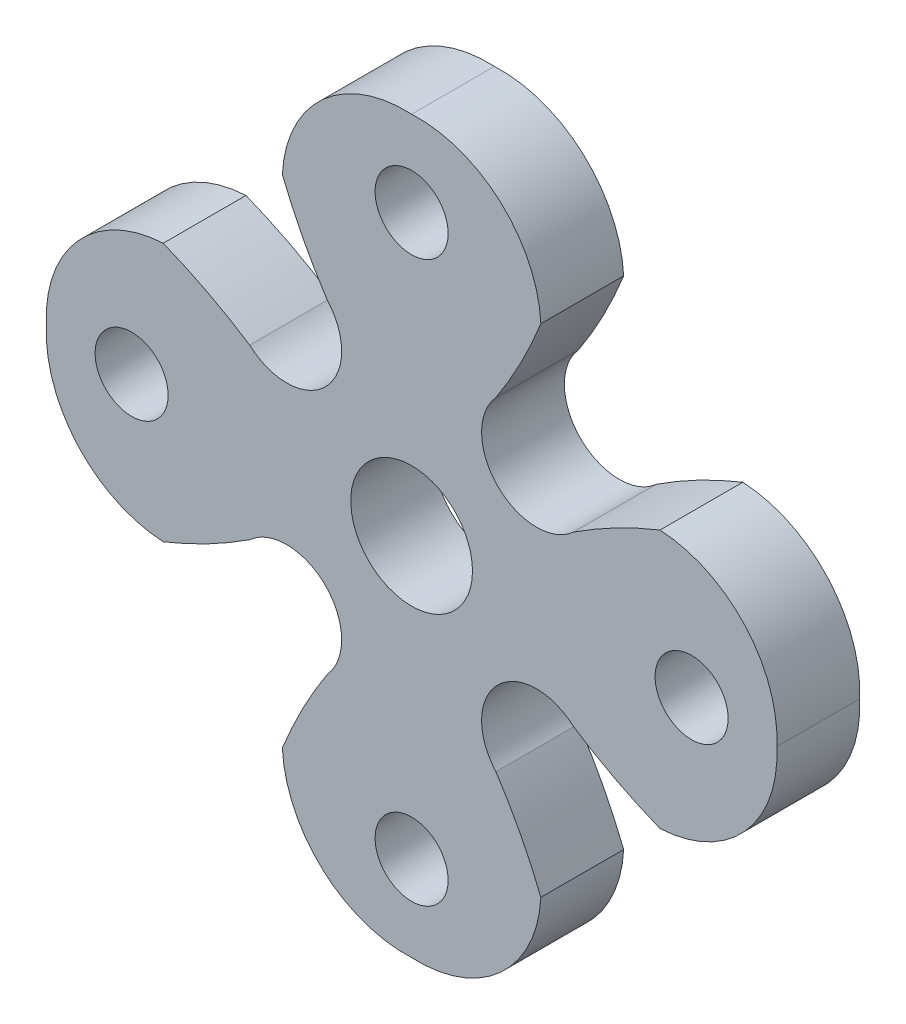
ISO-10303-21;
HEADER;
FILE_DESCRIPTION(('STEP AP214'),'2;1');
FILE_NAME('part.step','',(''),(''),'','','');
FILE_SCHEMA(('AUTOMOTIVE_DESIGN { 1 0 10303 214 1 1 1 1 }'));
ENDSEC;
DATA;
#1=APPLICATION_CONTEXT('core data for automotive mechanical design processes');
#2=APPLICATION_PROTOCOL_DEFINITION('international standard','automotive_design',2000,#1);
#3=PRODUCT_CONTEXT('',#1,'mechanical');
#4=PRODUCT('Part','Part','',(#3));
#5=PRODUCT_RELATED_PRODUCT_CATEGORY('part','',(#4));
#6=PRODUCT_DEFINITION_FORMATION('','',#4);
#7=PRODUCT_DEFINITION_CONTEXT('part definition',#1,'design');
#8=PRODUCT_DEFINITION('design','',#6,#7);
#9=PRODUCT_DEFINITION_SHAPE('','',#8);
#10=(LENGTH_UNIT() NAMED_UNIT(*) SI_UNIT(.MILLI.,.METRE.));
#11=(NAMED_UNIT(*) PLANE_ANGLE_UNIT() SI_UNIT($,.RADIAN.));
#12=(NAMED_UNIT(*) SI_UNIT($,.STERADIAN.) SOLID_ANGLE_UNIT());
#13=UNCERTAINTY_MEASURE_WITH_UNIT(LENGTH_MEASURE(1.E-05),#10,'distance_accuracy_value','');
#14=(GEOMETRIC_REPRESENTATION_CONTEXT(3) GLOBAL_UNCERTAINTY_ASSIGNED_CONTEXT((#13)) GLOBAL_UNIT_ASSIGNED_CONTEXT((#10,
#11,#12)) REPRESENTATION_CONTEXT('',''));
#15=CARTESIAN_POINT('',(0.,0.,0.));
#16=DIRECTION('',(0.,0.,1.));
#17=DIRECTION('',(1.,0.,0.));
#18=AXIS2_PLACEMENT_3D('',#15,#16,#17);
#19=CARTESIAN_POINT('',(0.,12.6314843790541,4.318));
#20=DIRECTION('',(0.,0.,1.));
#21=DIRECTION('',(1.,0.,0.));
#22=AXIS2_PLACEMENT_3D('',#19,#20,#21);
#23=PLANE('',#22);
#24=CARTESIAN_POINT('',(0.,-14.6050000000001,4.318));
#25=DIRECTION('',(0.,0.,1.));
#26=DIRECTION('',(1.,0.,0.));
#27=AXIS2_PLACEMENT_3D('',#24,#25,#26);
#28=CIRCLE('',#27,1.905);
#29=CARTESIAN_POINT('',(1.90499999999995,-14.6050000000001,4.318));
#30=VERTEX_POINT('',#29);
#31=EDGE_CURVE('E470',#30,#30,#28,.T.);
#32=ORIENTED_EDGE('',*,*,#31,.F.);
#33=EDGE_LOOP('',(#32));
#34=FACE_BOUND('',#33,.T.);
#35=CARTESIAN_POINT('',(0.,14.605,4.318));
#36=DIRECTION('',(0.,0.,1.));
#37=DIRECTION('',(1.,0.,0.));
#38=AXIS2_PLACEMENT_3D('',#35,#36,#37);
#39=CIRCLE('',#38,1.905);
#40=CARTESIAN_POINT('',(1.905,14.605,4.318));
#41=VERTEX_POINT('',#40);
#42=EDGE_CURVE('E486',#41,#41,#39,.T.);
#43=ORIENTED_EDGE('',*,*,#42,.F.);
#44=EDGE_LOOP('',(#43));
#45=FACE_BOUND('',#44,.T.);
#46=CARTESIAN_POINT('',(0.323998289302988,12.6314843790541,4.318));
#47=DIRECTION('',(0.,0.,1.));
#48=DIRECTION('',(1.,0.,0.));
#49=AXIS2_PLACEMENT_3D('',#46,#47,#48);
#50=CIRCLE('',#49,6.42668792363519);
#51=CARTESIAN_POINT('',(6.74251391024893,12.955482668357,4.318));
#52=VERTEX_POINT('',#51);
#53=CARTESIAN_POINT('',(0.,19.05,4.318));
#54=VERTEX_POINT('',#53);
#55=EDGE_CURVE('E278',#52,#54,#50,.T.);
#56=ORIENTED_EDGE('',*,*,#55,.T.);
#57=CARTESIAN_POINT('',(-0.323998289302988,12.6314843790541,4.318));
#58=DIRECTION('',(0.,0.,1.));
#59=DIRECTION('',(-1.,0.,0.));
#60=AXIS2_PLACEMENT_3D('',#57,#58,#59);
#61=CIRCLE('',#60,6.42668792363519);
#62=CARTESIAN_POINT('',(-6.74251391024893,12.955482668357,4.318));
#63=VERTEX_POINT('',#62);
#64=EDGE_CURVE('E142',#54,#63,#61,.T.);
#65=ORIENTED_EDGE('',*,*,#64,.T.);
#66=CARTESIAN_POINT('',(16.8484319813905,22.3696885264068,4.318));
#67=DIRECTION('',(0.,0.,1.));
#68=DIRECTION('',(1.,0.,0.));
#69=AXIS2_PLACEMENT_3D('',#66,#67,#68);
#70=CIRCLE('',#69,25.4);
#71=CARTESIAN_POINT('',(-4.39729168059713,8.44922782718938,4.318));
#72=VERTEX_POINT('',#71);
#73=EDGE_CURVE('E347',#63,#72,#70,.T.);
#74=ORIENTED_EDGE('',*,*,#73,.T.);
#75=CARTESIAN_POINT('',(-6.51832531290557,6.51832531290564,4.318));
#76=DIRECTION('',(0.,0.,-1.));
#77=DIRECTION('',(1.,0.,0.));
#78=AXIS2_PLACEMENT_3D('',#75,#76,#77);
#79=CIRCLE('',#78,2.86830406147096);
#80=CARTESIAN_POINT('',(-8.44922782718933,4.39729168059722,4.318));
#81=VERTEX_POINT('',#80);
#82=EDGE_CURVE('E367',#72,#81,#79,.T.);
#83=ORIENTED_EDGE('',*,*,#82,.T.);
#84=CARTESIAN_POINT('',(-22.369688526407,-16.8484319813903,4.318));
#85=DIRECTION('',(0.,0.,1.));
#86=DIRECTION('',(-1.,0.,0.));
#87=AXIS2_PLACEMENT_3D('',#84,#85,#86);
#88=CIRCLE('',#87,25.4);
#89=CARTESIAN_POINT('',(-12.955482668357,6.74251391024907,4.318));
#90=VERTEX_POINT('',#89);
#91=EDGE_CURVE('E363',#81,#90,#88,.T.);
#92=ORIENTED_EDGE('',*,*,#91,.T.);
#93=CARTESIAN_POINT('',(-12.6314843790541,0.323998289303122,4.318));
#94=DIRECTION('',(0.,0.,1.));
#95=DIRECTION('',(1.,0.,0.));
#96=AXIS2_PLACEMENT_3D('',#93,#94,#95);
#97=CIRCLE('',#96,6.42668792363519);
#98=CARTESIAN_POINT('',(-19.05,2.02366335494419E-13,4.318));
#99=VERTEX_POINT('',#98);
#100=EDGE_CURVE('E366',#90,#99,#97,.T.);
#101=ORIENTED_EDGE('',*,*,#100,.T.);
#102=CARTESIAN_POINT('',(-12.6314843790541,-0.323998289302854,4.318));
#103=DIRECTION('',(0.,0.,1.));
#104=DIRECTION('',(-1.,0.,0.));
#105=AXIS2_PLACEMENT_3D('',#102,#103,#104);
#106=CIRCLE('',#105,6.42668792363519);
#107=CARTESIAN_POINT('',(-12.9554826683571,-6.7425139102488,4.318));
#108=VERTEX_POINT('',#107);
#109=EDGE_CURVE('E371',#99,#108,#106,.T.);
#110=ORIENTED_EDGE('',*,*,#109,.T.);
#111=CARTESIAN_POINT('',(-22.3696885264066,16.8484319813908,4.318));
#112=DIRECTION('',(0.,0.,1.));
#113=DIRECTION('',(1.,0.,0.));
#114=AXIS2_PLACEMENT_3D('',#111,#112,#113);
#115=CIRCLE('',#114,25.4);
#116=CARTESIAN_POINT('',(-8.44922782718944,-4.39729168059705,4.318));
#117=VERTEX_POINT('',#116);
#118=EDGE_CURVE('E378',#108,#117,#115,.T.);
#119=ORIENTED_EDGE('',*,*,#118,.T.);
#120=CARTESIAN_POINT('',(-6.51832531290571,-6.5183253129055,4.318));
#121=DIRECTION('',(0.,0.,-1.));
#122=DIRECTION('',(1.,0.,0.));
#123=AXIS2_PLACEMENT_3D('',#120,#121,#122);
#124=CIRCLE('',#123,2.86830406147102);
#125=CARTESIAN_POINT('',(-4.39729168059724,-8.4492278271893,4.318));
#126=VERTEX_POINT('',#125);
#127=EDGE_CURVE('E381',#117,#126,#124,.T.);
#128=ORIENTED_EDGE('',*,*,#127,.T.);
#129=CARTESIAN_POINT('',(16.8484319813904,-22.3696885264069,4.318));
#130=DIRECTION('',(0.,0.,1.));
#131=DIRECTION('',(-1.,0.,0.));
#132=AXIS2_PLACEMENT_3D('',#129,#130,#131);
#133=CIRCLE('',#132,25.4);
#134=CARTESIAN_POINT('',(-6.74251391024902,-12.955482668357,4.318));
#135=VERTEX_POINT('',#134);
#136=EDGE_CURVE('E384',#126,#135,#133,.T.);
#137=ORIENTED_EDGE('',*,*,#136,.T.);
#138=CARTESIAN_POINT('',(-0.323998289303076,-12.6314843790541,4.318));
#139=DIRECTION('',(0.,0.,1.));
#140=DIRECTION('',(1.,0.,0.));
#141=AXIS2_PLACEMENT_3D('',#138,#139,#140);
#142=CIRCLE('',#141,6.42668792363519);
#143=CARTESIAN_POINT('',(-1.36880524276295E-13,-19.05,4.318));
#144=VERTEX_POINT('',#143);
#145=EDGE_CURVE('E387',#135,#144,#142,.T.);
#146=ORIENTED_EDGE('',*,*,#145,.T.);
#147=CARTESIAN_POINT('',(0.3239982893029,-12.6314843790541,4.318));
#148=DIRECTION('',(0.,0.,1.));
#149=DIRECTION('',(-1.,0.,0.));
#150=AXIS2_PLACEMENT_3D('',#147,#148,#149);
#151=CIRCLE('',#150,6.42668792363519);
#152=CARTESIAN_POINT('',(6.74251391024884,-12.9554826683571,4.318));
#153=VERTEX_POINT('',#152);
#154=EDGE_CURVE('E390',#144,#153,#151,.T.);
#155=ORIENTED_EDGE('',*,*,#154,.T.);
#156=CARTESIAN_POINT('',(-16.8484319813907,-22.3696885264067,4.318));
#157=DIRECTION('',(0.,0.,1.));
#158=DIRECTION('',(1.,0.,0.));
#159=AXIS2_PLACEMENT_3D('',#156,#157,#158);
#160=CIRCLE('',#159,25.4);
#161=CARTESIAN_POINT('',(4.39729168059707,-8.44922782718941,4.318));
#162=VERTEX_POINT('',#161);
#163=EDGE_CURVE('E393',#153,#162,#160,.T.);
#164=ORIENTED_EDGE('',*,*,#163,.T.);
#165=CARTESIAN_POINT('',(6.51832531290553,-6.51832531290569,4.318));
#166=DIRECTION('',(0.,0.,-1.));
#167=DIRECTION('',(1.,0.,0.));
#168=AXIS2_PLACEMENT_3D('',#165,#166,#167);
#169=CIRCLE('',#168,2.86830406147102);
#170=CARTESIAN_POINT('',(8.44922782718931,-4.3972916805972,4.318));
#171=VERTEX_POINT('',#170);
#172=EDGE_CURVE('E396',#162,#171,#169,.T.);
#173=ORIENTED_EDGE('',*,*,#172,.T.);
#174=CARTESIAN_POINT('',(22.3696885264069,16.8484319813905,4.318));
#175=DIRECTION('',(0.,0.,1.));
#176=DIRECTION('',(-1.,0.,0.));
#177=AXIS2_PLACEMENT_3D('',#174,#175,#176);
#178=CIRCLE('',#177,25.4);
#179=CARTESIAN_POINT('',(12.955482668357,-6.74251391024898,4.318));
#180=VERTEX_POINT('',#179);
#181=EDGE_CURVE('E399',#171,#180,#178,.T.);
#182=ORIENTED_EDGE('',*,*,#181,.T.);
#183=CARTESIAN_POINT('',(12.6314843790541,-0.323998289303032,4.318));
#184=DIRECTION('',(0.,0.,1.));
#185=DIRECTION('',(1.,0.,0.));
#186=AXIS2_PLACEMENT_3D('',#183,#184,#185);
#187=CIRCLE('',#186,6.42668792363519);
#188=CARTESIAN_POINT('',(19.05,0.,4.318));
#189=VERTEX_POINT('',#188);
#190=EDGE_CURVE('E402',#180,#189,#187,.T.);
#191=ORIENTED_EDGE('',*,*,#190,.T.);
#192=CARTESIAN_POINT('',(12.6314843790541,0.323998289302944,4.318));
#193=DIRECTION('',(0.,0.,1.));
#194=DIRECTION('',(-1.,0.,0.));
#195=AXIS2_PLACEMENT_3D('',#192,#193,#194);
#196=CIRCLE('',#195,6.42668792363519);
#197=CARTESIAN_POINT('',(12.9554826683571,6.74251391024889,4.318));
#198=VERTEX_POINT('',#197);
#199=EDGE_CURVE('E197',#189,#198,#196,.T.);
#200=ORIENTED_EDGE('',*,*,#199,.T.);
#201=CARTESIAN_POINT('',(22.3696885264067,-16.8484319813906,4.318));
#202=DIRECTION('',(0.,0.,1.));
#203=DIRECTION('',(1.,0.,0.));
#204=AXIS2_PLACEMENT_3D('',#201,#202,#203);
#205=CIRCLE('',#204,25.4);
#206=CARTESIAN_POINT('',(8.44922782718939,4.3972916805971,4.318));
#207=VERTEX_POINT('',#206);
#208=EDGE_CURVE('E191',#198,#207,#205,.T.);
#209=ORIENTED_EDGE('',*,*,#208,.T.);
#210=CARTESIAN_POINT('',(6.51832531290566,6.51832531290555,4.318));
#211=DIRECTION('',(0.,0.,-1.));
#212=DIRECTION('',(1.,0.,0.));
#213=AXIS2_PLACEMENT_3D('',#210,#211,#212);
#214=CIRCLE('',#213,2.86830406147102);
#215=CARTESIAN_POINT('',(4.39729168059718,8.44922782718933,4.318));
#216=VERTEX_POINT('',#215);
#217=EDGE_CURVE('E195',#207,#216,#214,.T.);
#218=ORIENTED_EDGE('',*,*,#217,.T.);
#219=CARTESIAN_POINT('',(-16.8484319813905,22.3696885264068,4.318));
#220=DIRECTION('',(0.,0.,1.));
#221=DIRECTION('',(-1.,0.,0.));
#222=AXIS2_PLACEMENT_3D('',#219,#220,#221);
#223=CIRCLE('',#222,25.4);
#224=EDGE_CURVE('E63',#216,#52,#223,.T.);
#225=ORIENTED_EDGE('',*,*,#224,.T.);
#226=EDGE_LOOP('',(#56,#65,#74,#83,#92,#101,#110,#119,#128,#137,#146,#155,#164,#173,#182,#191,
#200,#209,#218,#225));
#227=FACE_BOUND('',#226,.T.);
#228=CARTESIAN_POINT('',(0.,0.,4.318));
#229=DIRECTION('',(0.,0.,1.));
#230=DIRECTION('',(1.,0.,0.));
#231=AXIS2_PLACEMENT_3D('',#228,#229,#230);
#232=CIRCLE('',#231,3.175);
#233=CARTESIAN_POINT('',(3.175,0.,4.318));
#234=VERTEX_POINT('',#233);
#235=EDGE_CURVE('E224',#234,#234,#232,.T.);
#236=ORIENTED_EDGE('',*,*,#235,.F.);
#237=EDGE_LOOP('',(#236));
#238=FACE_BOUND('',#237,.T.);
#239=CARTESIAN_POINT('',(14.605,0.,4.318));
#240=DIRECTION('',(0.,0.,1.));
#241=DIRECTION('',(1.,0.,0.));
#242=AXIS2_PLACEMENT_3D('',#239,#240,#241);
#243=CIRCLE('',#242,1.905);
#244=CARTESIAN_POINT('',(16.51,0.,4.318));
#245=VERTEX_POINT('',#244);
#246=EDGE_CURVE('E478',#245,#245,#243,.T.);
#247=ORIENTED_EDGE('',*,*,#246,.F.);
#248=EDGE_LOOP('',(#247));
#249=FACE_BOUND('',#248,.T.);
#250=CARTESIAN_POINT('',(-14.6050000000001,0.,4.318));
#251=DIRECTION('',(0.,0.,1.));
#252=DIRECTION('',(1.,0.,0.));
#253=AXIS2_PLACEMENT_3D('',#250,#251,#252);
#254=CIRCLE('',#253,1.905);
#255=CARTESIAN_POINT('',(-12.7000000000001,0.,4.318));
#256=VERTEX_POINT('',#255);
#257=EDGE_CURVE('E459',#256,#256,#254,.T.);
#258=ORIENTED_EDGE('',*,*,#257,.F.);
#259=EDGE_LOOP('',(#258));
#260=FACE_BOUND('',#259,.T.);
#261=ADVANCED_FACE('F45',(#34,#45,#227,#238,#249,#260),#23,.T.);
#262=CARTESIAN_POINT('',(0.,12.6314843790541,0.));
#263=DIRECTION('',(0.,0.,1.));
#264=DIRECTION('',(1.,0.,0.));
#265=AXIS2_PLACEMENT_3D('',#262,#263,#264);
#266=PLANE('',#265);
#267=CARTESIAN_POINT('',(0.323998289302988,12.6314843790541,0.));
#268=DIRECTION('',(0.,0.,1.));
#269=DIRECTION('',(1.,0.,0.));
#270=AXIS2_PLACEMENT_3D('',#267,#268,#269);
#271=CIRCLE('',#270,6.42668792363519);
#272=CARTESIAN_POINT('',(6.74251391024893,12.955482668357,0.));
#273=VERTEX_POINT('',#272);
#274=CARTESIAN_POINT('',(0.,19.05,0.));
#275=VERTEX_POINT('',#274);
#276=EDGE_CURVE('E219',#273,#275,#271,.T.);
#277=ORIENTED_EDGE('',*,*,#276,.F.);
#278=CARTESIAN_POINT('',(-16.8484319813905,22.3696885264068,0.));
#279=DIRECTION('',(0.,0.,1.));
#280=DIRECTION('',(-1.,0.,0.));
#281=AXIS2_PLACEMENT_3D('',#278,#279,#280);
#282=CIRCLE('',#281,25.4);
#283=CARTESIAN_POINT('',(4.39729168059718,8.44922782718933,0.));
#284=VERTEX_POINT('',#283);
#285=EDGE_CURVE('E134',#284,#273,#282,.T.);
#286=ORIENTED_EDGE('',*,*,#285,.F.);
#287=CARTESIAN_POINT('',(6.51832531290566,6.51832531290555,0.));
#288=DIRECTION('',(0.,0.,-1.));
#289=DIRECTION('',(1.,0.,0.));
#290=AXIS2_PLACEMENT_3D('',#287,#288,#289);
#291=CIRCLE('',#290,2.86830406147102);
#292=CARTESIAN_POINT('',(8.44922782718939,4.3972916805971,0.));
#293=VERTEX_POINT('',#292);
#294=EDGE_CURVE('E128',#293,#284,#291,.T.);
#295=ORIENTED_EDGE('',*,*,#294,.F.);
#296=CARTESIAN_POINT('',(22.3696885264067,-16.8484319813906,0.));
#297=DIRECTION('',(0.,0.,1.));
#298=DIRECTION('',(1.,0.,0.));
#299=AXIS2_PLACEMENT_3D('',#296,#297,#298);
#300=CIRCLE('',#299,25.4);
#301=CARTESIAN_POINT('',(12.9554826683571,6.74251391024889,0.));
#302=VERTEX_POINT('',#301);
#303=EDGE_CURVE('E206',#302,#293,#300,.T.);
#304=ORIENTED_EDGE('',*,*,#303,.F.);
#305=CARTESIAN_POINT('',(12.6314843790541,0.323998289302944,0.));
#306=DIRECTION('',(0.,0.,1.));
#307=DIRECTION('',(-1.,0.,0.));
#308=AXIS2_PLACEMENT_3D('',#305,#306,#307);
#309=CIRCLE('',#308,6.42668792363519);
#310=CARTESIAN_POINT('',(19.05,0.,0.));
#311=VERTEX_POINT('',#310);
#312=EDGE_CURVE('E269',#311,#302,#309,.T.);
#313=ORIENTED_EDGE('',*,*,#312,.F.);
#314=CARTESIAN_POINT('',(12.6314843790541,-0.323998289303032,0.));
#315=DIRECTION('',(0.,0.,1.));
#316=DIRECTION('',(1.,0.,0.));
#317=AXIS2_PLACEMENT_3D('',#314,#315,#316);
#318=CIRCLE('',#317,6.42668792363519);
#319=CARTESIAN_POINT('',(12.955482668357,-6.74251391024898,0.));
#320=VERTEX_POINT('',#319);
#321=EDGE_CURVE('E266',#320,#311,#318,.T.);
#322=ORIENTED_EDGE('',*,*,#321,.F.);
#323=CARTESIAN_POINT('',(22.3696885264069,16.8484319813905,0.));
#324=DIRECTION('',(0.,0.,1.));
#325=DIRECTION('',(-1.,0.,0.));
#326=AXIS2_PLACEMENT_3D('',#323,#324,#325);
#327=CIRCLE('',#326,25.4);
#328=CARTESIAN_POINT('',(8.44922782718931,-4.3972916805972,0.));
#329=VERTEX_POINT('',#328);
#330=EDGE_CURVE('E263',#329,#320,#327,.T.);
#331=ORIENTED_EDGE('',*,*,#330,.F.);
#332=CARTESIAN_POINT('',(6.51832531290553,-6.51832531290569,0.));
#333=DIRECTION('',(0.,0.,-1.));
#334=DIRECTION('',(1.,0.,0.));
#335=AXIS2_PLACEMENT_3D('',#332,#333,#334);
#336=CIRCLE('',#335,2.86830406147102);
#337=CARTESIAN_POINT('',(4.39729168059707,-8.44922782718941,0.));
#338=VERTEX_POINT('',#337);
#339=EDGE_CURVE('E260',#338,#329,#336,.T.);
#340=ORIENTED_EDGE('',*,*,#339,.F.);
#341=CARTESIAN_POINT('',(-16.8484319813907,-22.3696885264067,0.));
#342=DIRECTION('',(0.,0.,1.));
#343=DIRECTION('',(1.,0.,0.));
#344=AXIS2_PLACEMENT_3D('',#341,#342,#343);
#345=CIRCLE('',#344,25.4);
#346=CARTESIAN_POINT('',(6.74251391024884,-12.9554826683571,0.));
#347=VERTEX_POINT('',#346);
#348=EDGE_CURVE('E257',#347,#338,#345,.T.);
#349=ORIENTED_EDGE('',*,*,#348,.F.);
#350=CARTESIAN_POINT('',(0.3239982893029,-12.6314843790541,0.));
#351=DIRECTION('',(0.,0.,1.));
#352=DIRECTION('',(-1.,0.,0.));
#353=AXIS2_PLACEMENT_3D('',#350,#351,#352);
#354=CIRCLE('',#353,6.42668792363519);
#355=CARTESIAN_POINT('',(-1.36880524276295E-13,-19.05,0.));
#356=VERTEX_POINT('',#355);
#357=EDGE_CURVE('E254',#356,#347,#354,.T.);
#358=ORIENTED_EDGE('',*,*,#357,.F.);
#359=CARTESIAN_POINT('',(-0.323998289303076,-12.6314843790541,0.));
#360=DIRECTION('',(0.,0.,1.));
#361=DIRECTION('',(1.,0.,0.));
#362=AXIS2_PLACEMENT_3D('',#359,#360,#361);
#363=CIRCLE('',#362,6.42668792363519);
#364=CARTESIAN_POINT('',(-6.74251391024902,-12.955482668357,0.));
#365=VERTEX_POINT('',#364);
#366=EDGE_CURVE('E251',#365,#356,#363,.T.);
#367=ORIENTED_EDGE('',*,*,#366,.F.);
#368=CARTESIAN_POINT('',(16.8484319813904,-22.3696885264069,0.));
#369=DIRECTION('',(0.,0.,1.));
#370=DIRECTION('',(-1.,0.,0.));
#371=AXIS2_PLACEMENT_3D('',#368,#369,#370);
#372=CIRCLE('',#371,25.4);
#373=CARTESIAN_POINT('',(-4.39729168059724,-8.4492278271893,0.));
#374=VERTEX_POINT('',#373);
#375=EDGE_CURVE('E248',#374,#365,#372,.T.);
#376=ORIENTED_EDGE('',*,*,#375,.F.);
#377=CARTESIAN_POINT('',(-6.51832531290571,-6.5183253129055,0.));
#378=DIRECTION('',(0.,0.,-1.));
#379=DIRECTION('',(1.,0.,0.));
#380=AXIS2_PLACEMENT_3D('',#377,#378,#379);
#381=CIRCLE('',#380,2.86830406147102);
#382=CARTESIAN_POINT('',(-8.44922782718944,-4.39729168059705,0.));
#383=VERTEX_POINT('',#382);
#384=EDGE_CURVE('E245',#383,#374,#381,.T.);
#385=ORIENTED_EDGE('',*,*,#384,.F.);
#386=CARTESIAN_POINT('',(-22.3696885264066,16.8484319813908,0.));
#387=DIRECTION('',(0.,0.,1.));
#388=DIRECTION('',(1.,0.,0.));
#389=AXIS2_PLACEMENT_3D('',#386,#387,#388);
#390=CIRCLE('',#389,25.4);
#391=CARTESIAN_POINT('',(-12.9554826683571,-6.7425139102488,0.));
#392=VERTEX_POINT('',#391);
#393=EDGE_CURVE('E242',#392,#383,#390,.T.);
#394=ORIENTED_EDGE('',*,*,#393,.F.);
#395=CARTESIAN_POINT('',(-12.6314843790541,-0.323998289302854,0.));
#396=DIRECTION('',(0.,0.,1.));
#397=DIRECTION('',(-1.,0.,0.));
#398=AXIS2_PLACEMENT_3D('',#395,#396,#397);
#399=CIRCLE('',#398,6.42668792363519);
#400=CARTESIAN_POINT('',(-19.05,2.02366335494419E-13,0.));
#401=VERTEX_POINT('',#400);
#402=EDGE_CURVE('E239',#401,#392,#399,.T.);
#403=ORIENTED_EDGE('',*,*,#402,.F.);
#404=CARTESIAN_POINT('',(-12.6314843790541,0.323998289303122,0.));
#405=DIRECTION('',(0.,0.,1.));
#406=DIRECTION('',(1.,0.,0.));
#407=AXIS2_PLACEMENT_3D('',#404,#405,#406);
#408=CIRCLE('',#407,6.42668792363519);
#409=CARTESIAN_POINT('',(-12.955482668357,6.74251391024907,0.));
#410=VERTEX_POINT('',#409);
#411=EDGE_CURVE('E236',#410,#401,#408,.T.);
#412=ORIENTED_EDGE('',*,*,#411,.F.);
#413=CARTESIAN_POINT('',(-22.369688526407,-16.8484319813903,0.));
#414=DIRECTION('',(0.,0.,1.));
#415=DIRECTION('',(-1.,0.,0.));
#416=AXIS2_PLACEMENT_3D('',#413,#414,#415);
#417=CIRCLE('',#416,25.4);
#418=CARTESIAN_POINT('',(-8.44922782718933,4.39729168059722,0.));
#419=VERTEX_POINT('',#418);
#420=EDGE_CURVE('E233',#419,#410,#417,.T.);
#421=ORIENTED_EDGE('',*,*,#420,.F.);
#422=CARTESIAN_POINT('',(-6.51832531290557,6.51832531290564,0.));
#423=DIRECTION('',(0.,0.,-1.));
#424=DIRECTION('',(1.,0.,0.));
#425=AXIS2_PLACEMENT_3D('',#422,#423,#424);
#426=CIRCLE('',#425,2.86830406147096);
#427=CARTESIAN_POINT('',(-4.39729168059713,8.44922782718938,0.));
#428=VERTEX_POINT('',#427);
#429=EDGE_CURVE('E230',#428,#419,#426,.T.);
#430=ORIENTED_EDGE('',*,*,#429,.F.);
#431=CARTESIAN_POINT('',(16.8484319813905,22.3696885264068,0.));
#432=DIRECTION('',(0.,0.,1.));
#433=DIRECTION('',(1.,0.,0.));
#434=AXIS2_PLACEMENT_3D('',#431,#432,#433);
#435=CIRCLE('',#434,25.4);
#436=CARTESIAN_POINT('',(-6.74251391024893,12.955482668357,0.));
#437=VERTEX_POINT('',#436);
#438=EDGE_CURVE('E227',#437,#428,#435,.T.);
#439=ORIENTED_EDGE('',*,*,#438,.F.);
#440=CARTESIAN_POINT('',(-0.323998289302988,12.6314843790541,0.));
#441=DIRECTION('',(0.,0.,1.));
#442=DIRECTION('',(-1.,0.,0.));
#443=AXIS2_PLACEMENT_3D('',#440,#441,#442);
#444=CIRCLE('',#443,6.42668792363519);
#445=EDGE_CURVE('E223',#275,#437,#444,.T.);
#446=ORIENTED_EDGE('',*,*,#445,.F.);
#447=EDGE_LOOP('',(#277,#286,#295,#304,#313,#322,#331,#340,#349,#358,#367,#376,#385,#394,#403,
#412,#421,#430,#439,#446));
#448=FACE_BOUND('',#447,.T.);
#449=CARTESIAN_POINT('',(0.,0.,0.));
#450=DIRECTION('',(0.,0.,1.));
#451=DIRECTION('',(1.,0.,0.));
#452=AXIS2_PLACEMENT_3D('',#449,#450,#451);
#453=CIRCLE('',#452,3.175);
#454=CARTESIAN_POINT('',(3.175,0.,0.));
#455=VERTEX_POINT('',#454);
#456=EDGE_CURVE('E490',#455,#455,#453,.T.);
#457=ORIENTED_EDGE('',*,*,#456,.T.);
#458=EDGE_LOOP('',(#457));
#459=FACE_BOUND('',#458,.T.);
#460=CARTESIAN_POINT('',(0.,14.605,0.));
#461=DIRECTION('',(0.,0.,1.));
#462=DIRECTION('',(1.,0.,0.));
#463=AXIS2_PLACEMENT_3D('',#460,#461,#462);
#464=CIRCLE('',#463,1.905);
#465=CARTESIAN_POINT('',(1.905,14.605,0.));
#466=VERTEX_POINT('',#465);
#467=EDGE_CURVE('E482',#466,#466,#464,.T.);
#468=ORIENTED_EDGE('',*,*,#467,.T.);
#469=EDGE_LOOP('',(#468));
#470=FACE_BOUND('',#469,.T.);
#471=CARTESIAN_POINT('',(14.605,0.,0.));
#472=DIRECTION('',(0.,0.,1.));
#473=DIRECTION('',(1.,0.,0.));
#474=AXIS2_PLACEMENT_3D('',#471,#472,#473);
#475=CIRCLE('',#474,1.905);
#476=CARTESIAN_POINT('',(16.51,0.,0.));
#477=VERTEX_POINT('',#476);
#478=EDGE_CURVE('E474',#477,#477,#475,.T.);
#479=ORIENTED_EDGE('',*,*,#478,.T.);
#480=EDGE_LOOP('',(#479));
#481=FACE_BOUND('',#480,.T.);
#482=CARTESIAN_POINT('',(0.,-14.6050000000001,0.));
#483=DIRECTION('',(0.,0.,1.));
#484=DIRECTION('',(1.,0.,0.));
#485=AXIS2_PLACEMENT_3D('',#482,#483,#484);
#486=CIRCLE('',#485,1.905);
#487=CARTESIAN_POINT('',(1.90499999999995,-14.6050000000001,0.));
#488=VERTEX_POINT('',#487);
#489=EDGE_CURVE('E467',#488,#488,#486,.T.);
#490=ORIENTED_EDGE('',*,*,#489,.T.);
#491=EDGE_LOOP('',(#490));
#492=FACE_BOUND('',#491,.T.);
#493=CARTESIAN_POINT('',(-14.6050000000001,0.,0.));
#494=DIRECTION('',(0.,0.,1.));
#495=DIRECTION('',(1.,0.,0.));
#496=AXIS2_PLACEMENT_3D('',#493,#494,#495);
#497=CIRCLE('',#496,1.905);
#498=CARTESIAN_POINT('',(-12.7000000000001,0.,0.));
#499=VERTEX_POINT('',#498);
#500=EDGE_CURVE('E462',#499,#499,#497,.T.);
#501=ORIENTED_EDGE('',*,*,#500,.T.);
#502=EDGE_LOOP('',(#501));
#503=FACE_BOUND('',#502,.T.);
#504=ADVANCED_FACE('F351',(#448,#459,#470,#481,#492,#503),#266,.F.);
#505=CARTESIAN_POINT('',(0.323998289302988,12.6314843790541,4.318));
#506=DIRECTION('',(0.,0.,-1.));
#507=DIRECTION('',(-1.,0.,0.));
#508=AXIS2_PLACEMENT_3D('',#505,#506,#507);
#509=CYLINDRICAL_SURFACE('',#508,6.42668792363519);
#510=ORIENTED_EDGE('',*,*,#276,.T.);
#511=DIRECTION('',(0.,0.,-1.));
#512=VECTOR('',#511,1.);
#513=CARTESIAN_POINT('',(0.,19.05,4.318));
#514=LINE('',#513,#512);
#515=EDGE_CURVE('E11',#54,#275,#514,.T.);
#516=ORIENTED_EDGE('',*,*,#515,.F.);
#517=ORIENTED_EDGE('',*,*,#55,.F.);
#518=DIRECTION('',(0.,0.,-1.));
#519=VECTOR('',#518,1.);
#520=CARTESIAN_POINT('',(6.74251391024893,12.955482668357,4.318));
#521=LINE('',#520,#519);
#522=EDGE_CURVE('E215',#52,#273,#521,.T.);
#523=ORIENTED_EDGE('',*,*,#522,.T.);
#524=EDGE_LOOP('',(#510,#516,#517,#523));
#525=FACE_BOUND('',#524,.T.);
#526=ADVANCED_FACE('F47',(#525),#509,.T.);
#527=CARTESIAN_POINT('',(-0.323998289302988,12.6314843790541,4.318));
#528=DIRECTION('',(0.,0.,-1.));
#529=DIRECTION('',(-1.,0.,0.));
#530=AXIS2_PLACEMENT_3D('',#527,#528,#529);
#531=CYLINDRICAL_SURFACE('',#530,6.42668792363519);
#532=ORIENTED_EDGE('',*,*,#445,.T.);
#533=DIRECTION('',(0.,0.,-1.));
#534=VECTOR('',#533,1.);
#535=CARTESIAN_POINT('',(-6.74251391024893,12.955482668357,4.318));
#536=LINE('',#535,#534);
#537=EDGE_CURVE('E55',#63,#437,#536,.T.);
#538=ORIENTED_EDGE('',*,*,#537,.F.);
#539=ORIENTED_EDGE('',*,*,#64,.F.);
#540=ORIENTED_EDGE('',*,*,#515,.T.);
#541=EDGE_LOOP('',(#532,#538,#539,#540));
#542=FACE_BOUND('',#541,.T.);
#543=ADVANCED_FACE('F700',(#542),#531,.T.);
#544=CARTESIAN_POINT('',(16.8484319813905,22.3696885264068,4.318));
#545=DIRECTION('',(0.,0.,-1.));
#546=DIRECTION('',(-1.,0.,0.));
#547=AXIS2_PLACEMENT_3D('',#544,#545,#546);
#548=CYLINDRICAL_SURFACE('',#547,25.4);
#549=ORIENTED_EDGE('',*,*,#438,.T.);
#550=DIRECTION('',(0.,0.,-1.));
#551=VECTOR('',#550,1.);
#552=CARTESIAN_POINT('',(-4.39729168059713,8.44922782718938,4.318));
#553=LINE('',#552,#551);
#554=EDGE_CURVE('E337',#72,#428,#553,.T.);
#555=ORIENTED_EDGE('',*,*,#554,.F.);
#556=ORIENTED_EDGE('',*,*,#73,.F.);
#557=ORIENTED_EDGE('',*,*,#537,.T.);
#558=EDGE_LOOP('',(#549,#555,#556,#557));
#559=FACE_BOUND('',#558,.T.);
#560=ADVANCED_FACE('F345',(#559),#548,.T.);
#561=CARTESIAN_POINT('',(-6.51832531290557,6.51832531290564,4.318));
#562=DIRECTION('',(0.,0.,-1.));
#563=DIRECTION('',(-1.,0.,0.));
#564=AXIS2_PLACEMENT_3D('',#561,#562,#563);
#565=CYLINDRICAL_SURFACE('',#564,2.86830406147096);
#566=ORIENTED_EDGE('',*,*,#429,.T.);
#567=DIRECTION('',(0.,0.,-1.));
#568=VECTOR('',#567,1.);
#569=CARTESIAN_POINT('',(-8.44922782718933,4.39729168059722,4.318));
#570=LINE('',#569,#568);
#571=EDGE_CURVE('E333',#81,#419,#570,.T.);
#572=ORIENTED_EDGE('',*,*,#571,.F.);
#573=ORIENTED_EDGE('',*,*,#82,.F.);
#574=ORIENTED_EDGE('',*,*,#554,.T.);
#575=EDGE_LOOP('',(#566,#572,#573,#574));
#576=FACE_BOUND('',#575,.T.);
#577=ADVANCED_FACE('F357',(#576),#565,.F.);
#578=CARTESIAN_POINT('',(-22.369688526407,-16.8484319813903,4.318));
#579=DIRECTION('',(0.,0.,-1.));
#580=DIRECTION('',(-1.,0.,0.));
#581=AXIS2_PLACEMENT_3D('',#578,#579,#580);
#582=CYLINDRICAL_SURFACE('',#581,25.4);
#583=ORIENTED_EDGE('',*,*,#420,.T.);
#584=DIRECTION('',(0.,0.,-1.));
#585=VECTOR('',#584,1.);
#586=CARTESIAN_POINT('',(-12.955482668357,6.74251391024907,4.318));
#587=LINE('',#586,#585);
#588=EDGE_CURVE('E329',#90,#410,#587,.T.);
#589=ORIENTED_EDGE('',*,*,#588,.F.);
#590=ORIENTED_EDGE('',*,*,#91,.F.);
#591=ORIENTED_EDGE('',*,*,#571,.T.);
#592=EDGE_LOOP('',(#583,#589,#590,#591));
#593=FACE_BOUND('',#592,.T.);
#594=ADVANCED_FACE('F361',(#593),#582,.T.);
#595=CARTESIAN_POINT('',(-12.6314843790541,0.323998289303122,4.318));
#596=DIRECTION('',(0.,0.,-1.));
#597=DIRECTION('',(-1.,0.,0.));
#598=AXIS2_PLACEMENT_3D('',#595,#596,#597);
#599=CYLINDRICAL_SURFACE('',#598,6.42668792363519);
#600=ORIENTED_EDGE('',*,*,#411,.T.);
#601=DIRECTION('',(0.,0.,-1.));
#602=VECTOR('',#601,1.);
#603=CARTESIAN_POINT('',(-19.05,2.02366335494419E-13,4.318));
#604=LINE('',#603,#602);
#605=EDGE_CURVE('E325',#99,#401,#604,.T.);
#606=ORIENTED_EDGE('',*,*,#605,.F.);
#607=ORIENTED_EDGE('',*,*,#100,.F.);
#608=ORIENTED_EDGE('',*,*,#588,.T.);
#609=EDGE_LOOP('',(#600,#606,#607,#608));
#610=FACE_BOUND('',#609,.T.);
#611=ADVANCED_FACE('F665',(#610),#599,.T.);
#612=CARTESIAN_POINT('',(-12.6314843790541,-0.323998289302854,4.318));
#613=DIRECTION('',(0.,0.,-1.));
#614=DIRECTION('',(-1.,0.,0.));
#615=AXIS2_PLACEMENT_3D('',#612,#613,#614);
#616=CYLINDRICAL_SURFACE('',#615,6.42668792363519);
#617=ORIENTED_EDGE('',*,*,#402,.T.);
#618=DIRECTION('',(0.,0.,-1.));
#619=VECTOR('',#618,1.);
#620=CARTESIAN_POINT('',(-12.9554826683571,-6.7425139102488,4.318));
#621=LINE('',#620,#619);
#622=EDGE_CURVE('E321',#108,#392,#621,.T.);
#623=ORIENTED_EDGE('',*,*,#622,.F.);
#624=ORIENTED_EDGE('',*,*,#109,.F.);
#625=ORIENTED_EDGE('',*,*,#605,.T.);
#626=EDGE_LOOP('',(#617,#623,#624,#625));
#627=FACE_BOUND('',#626,.T.);
#628=ADVANCED_FACE('F655',(#627),#616,.T.);
#629=CARTESIAN_POINT('',(-22.3696885264066,16.8484319813908,4.318));
#630=DIRECTION('',(0.,0.,-1.));
#631=DIRECTION('',(-1.,0.,0.));
#632=AXIS2_PLACEMENT_3D('',#629,#630,#631);
#633=CYLINDRICAL_SURFACE('',#632,25.4);
#634=ORIENTED_EDGE('',*,*,#393,.T.);
#635=DIRECTION('',(0.,0.,-1.));
#636=VECTOR('',#635,1.);
#637=CARTESIAN_POINT('',(-8.44922782718944,-4.39729168059705,4.318));
#638=LINE('',#637,#636);
#639=EDGE_CURVE('E317',#117,#383,#638,.T.);
#640=ORIENTED_EDGE('',*,*,#639,.F.);
#641=ORIENTED_EDGE('',*,*,#118,.F.);
#642=ORIENTED_EDGE('',*,*,#622,.T.);
#643=EDGE_LOOP('',(#634,#640,#641,#642));
#644=FACE_BOUND('',#643,.T.);
#645=ADVANCED_FACE('F645',(#644),#633,.T.);
#646=CARTESIAN_POINT('',(-6.51832531290571,-6.5183253129055,4.318));
#647=DIRECTION('',(0.,0.,-1.));
#648=DIRECTION('',(-1.,0.,0.));
#649=AXIS2_PLACEMENT_3D('',#646,#647,#648);
#650=CYLINDRICAL_SURFACE('',#649,2.86830406147102);
#651=ORIENTED_EDGE('',*,*,#384,.T.);
#652=DIRECTION('',(0.,0.,-1.));
#653=VECTOR('',#652,1.);
#654=CARTESIAN_POINT('',(-4.39729168059724,-8.4492278271893,4.318));
#655=LINE('',#654,#653);
#656=EDGE_CURVE('E313',#126,#374,#655,.T.);
#657=ORIENTED_EDGE('',*,*,#656,.F.);
#658=ORIENTED_EDGE('',*,*,#127,.F.);
#659=ORIENTED_EDGE('',*,*,#639,.T.);
#660=EDGE_LOOP('',(#651,#657,#658,#659));
#661=FACE_BOUND('',#660,.T.);
#662=ADVANCED_FACE('F635',(#661),#650,.F.);
#663=CARTESIAN_POINT('',(16.8484319813904,-22.3696885264069,4.318));
#664=DIRECTION('',(0.,0.,-1.));
#665=DIRECTION('',(-1.,0.,0.));
#666=AXIS2_PLACEMENT_3D('',#663,#664,#665);
#667=CYLINDRICAL_SURFACE('',#666,25.4);
#668=ORIENTED_EDGE('',*,*,#375,.T.);
#669=DIRECTION('',(0.,0.,-1.));
#670=VECTOR('',#669,1.);
#671=CARTESIAN_POINT('',(-6.74251391024902,-12.955482668357,4.318));
#672=LINE('',#671,#670);
#673=EDGE_CURVE('E309',#135,#365,#672,.T.);
#674=ORIENTED_EDGE('',*,*,#673,.F.);
#675=ORIENTED_EDGE('',*,*,#136,.F.);
#676=ORIENTED_EDGE('',*,*,#656,.T.);
#677=EDGE_LOOP('',(#668,#674,#675,#676));
#678=FACE_BOUND('',#677,.T.);
#679=ADVANCED_FACE('F625',(#678),#667,.T.);
#680=CARTESIAN_POINT('',(-0.323998289303076,-12.6314843790541,4.318));
#681=DIRECTION('',(0.,0.,-1.));
#682=DIRECTION('',(-1.,0.,0.));
#683=AXIS2_PLACEMENT_3D('',#680,#681,#682);
#684=CYLINDRICAL_SURFACE('',#683,6.42668792363519);
#685=ORIENTED_EDGE('',*,*,#366,.T.);
#686=DIRECTION('',(0.,0.,-1.));
#687=VECTOR('',#686,1.);
#688=CARTESIAN_POINT('',(-1.36880524276295E-13,-19.05,4.318));
#689=LINE('',#688,#687);
#690=EDGE_CURVE('E305',#144,#356,#689,.T.);
#691=ORIENTED_EDGE('',*,*,#690,.F.);
#692=ORIENTED_EDGE('',*,*,#145,.F.);
#693=ORIENTED_EDGE('',*,*,#673,.T.);
#694=EDGE_LOOP('',(#685,#691,#692,#693));
#695=FACE_BOUND('',#694,.T.);
#696=ADVANCED_FACE('F615',(#695),#684,.T.);
#697=CARTESIAN_POINT('',(0.3239982893029,-12.6314843790541,4.318));
#698=DIRECTION('',(0.,0.,-1.));
#699=DIRECTION('',(-1.,0.,0.));
#700=AXIS2_PLACEMENT_3D('',#697,#698,#699);
#701=CYLINDRICAL_SURFACE('',#700,6.42668792363519);
#702=ORIENTED_EDGE('',*,*,#357,.T.);
#703=DIRECTION('',(0.,0.,-1.));
#704=VECTOR('',#703,1.);
#705=CARTESIAN_POINT('',(6.74251391024884,-12.9554826683571,4.318));
#706=LINE('',#705,#704);
#707=EDGE_CURVE('E301',#153,#347,#706,.T.);
#708=ORIENTED_EDGE('',*,*,#707,.F.);
#709=ORIENTED_EDGE('',*,*,#154,.F.);
#710=ORIENTED_EDGE('',*,*,#690,.T.);
#711=EDGE_LOOP('',(#702,#708,#709,#710));
#712=FACE_BOUND('',#711,.T.);
#713=ADVANCED_FACE('F605',(#712),#701,.T.);
#714=CARTESIAN_POINT('',(-16.8484319813907,-22.3696885264067,4.318));
#715=DIRECTION('',(0.,0.,-1.));
#716=DIRECTION('',(-1.,0.,0.));
#717=AXIS2_PLACEMENT_3D('',#714,#715,#716);
#718=CYLINDRICAL_SURFACE('',#717,25.4);
#719=ORIENTED_EDGE('',*,*,#348,.T.);
#720=DIRECTION('',(0.,0.,-1.));
#721=VECTOR('',#720,1.);
#722=CARTESIAN_POINT('',(4.39729168059707,-8.44922782718941,4.318));
#723=LINE('',#722,#721);
#724=EDGE_CURVE('E297',#162,#338,#723,.T.);
#725=ORIENTED_EDGE('',*,*,#724,.F.);
#726=ORIENTED_EDGE('',*,*,#163,.F.);
#727=ORIENTED_EDGE('',*,*,#707,.T.);
#728=EDGE_LOOP('',(#719,#725,#726,#727));
#729=FACE_BOUND('',#728,.T.);
#730=ADVANCED_FACE('F595',(#729),#718,.T.);
#731=CARTESIAN_POINT('',(6.51832531290553,-6.51832531290569,4.318));
#732=DIRECTION('',(0.,0.,-1.));
#733=DIRECTION('',(-1.,0.,0.));
#734=AXIS2_PLACEMENT_3D('',#731,#732,#733);
#735=CYLINDRICAL_SURFACE('',#734,2.86830406147102);
#736=ORIENTED_EDGE('',*,*,#339,.T.);
#737=DIRECTION('',(0.,0.,-1.));
#738=VECTOR('',#737,1.);
#739=CARTESIAN_POINT('',(8.44922782718931,-4.3972916805972,4.318));
#740=LINE('',#739,#738);
#741=EDGE_CURVE('E293',#171,#329,#740,.T.);
#742=ORIENTED_EDGE('',*,*,#741,.F.);
#743=ORIENTED_EDGE('',*,*,#172,.F.);
#744=ORIENTED_EDGE('',*,*,#724,.T.);
#745=EDGE_LOOP('',(#736,#742,#743,#744));
#746=FACE_BOUND('',#745,.T.);
#747=ADVANCED_FACE('F585',(#746),#735,.F.);
#748=CARTESIAN_POINT('',(22.3696885264069,16.8484319813905,4.318));
#749=DIRECTION('',(0.,0.,-1.));
#750=DIRECTION('',(-1.,0.,0.));
#751=AXIS2_PLACEMENT_3D('',#748,#749,#750);
#752=CYLINDRICAL_SURFACE('',#751,25.4);
#753=ORIENTED_EDGE('',*,*,#330,.T.);
#754=DIRECTION('',(0.,0.,-1.));
#755=VECTOR('',#754,1.);
#756=CARTESIAN_POINT('',(12.955482668357,-6.74251391024898,4.318));
#757=LINE('',#756,#755);
#758=EDGE_CURVE('E289',#180,#320,#757,.T.);
#759=ORIENTED_EDGE('',*,*,#758,.F.);
#760=ORIENTED_EDGE('',*,*,#181,.F.);
#761=ORIENTED_EDGE('',*,*,#741,.T.);
#762=EDGE_LOOP('',(#753,#759,#760,#761));
#763=FACE_BOUND('',#762,.T.);
#764=ADVANCED_FACE('F576',(#763),#752,.T.);
#765=CARTESIAN_POINT('',(12.6314843790541,-0.323998289303032,4.318));
#766=DIRECTION('',(0.,0.,-1.));
#767=DIRECTION('',(-1.,0.,0.));
#768=AXIS2_PLACEMENT_3D('',#765,#766,#767);
#769=CYLINDRICAL_SURFACE('',#768,6.42668792363519);
#770=ORIENTED_EDGE('',*,*,#321,.T.);
#771=DIRECTION('',(0.,0.,-1.));
#772=VECTOR('',#771,1.);
#773=CARTESIAN_POINT('',(19.05,0.,4.318));
#774=LINE('',#773,#772);
#775=EDGE_CURVE('E285',#189,#311,#774,.T.);
#776=ORIENTED_EDGE('',*,*,#775,.F.);
#777=ORIENTED_EDGE('',*,*,#190,.F.);
#778=ORIENTED_EDGE('',*,*,#758,.T.);
#779=EDGE_LOOP('',(#770,#776,#777,#778));
#780=FACE_BOUND('',#779,.T.);
#781=ADVANCED_FACE('F410',(#780),#769,.T.);
#782=CARTESIAN_POINT('',(12.6314843790541,0.323998289302944,4.318));
#783=DIRECTION('',(0.,0.,-1.));
#784=DIRECTION('',(-1.,0.,0.));
#785=AXIS2_PLACEMENT_3D('',#782,#783,#784);
#786=CYLINDRICAL_SURFACE('',#785,6.42668792363519);
#787=ORIENTED_EDGE('',*,*,#312,.T.);
#788=DIRECTION('',(0.,0.,-1.));
#789=VECTOR('',#788,1.);
#790=CARTESIAN_POINT('',(12.9554826683571,6.74251391024889,4.318));
#791=LINE('',#790,#789);
#792=EDGE_CURVE('E208',#198,#302,#791,.T.);
#793=ORIENTED_EDGE('',*,*,#792,.F.);
#794=ORIENTED_EDGE('',*,*,#199,.F.);
#795=ORIENTED_EDGE('',*,*,#775,.T.);
#796=EDGE_LOOP('',(#787,#793,#794,#795));
#797=FACE_BOUND('',#796,.T.);
#798=ADVANCED_FACE('F414',(#797),#786,.T.);
#799=CARTESIAN_POINT('',(22.3696885264067,-16.8484319813906,4.318));
#800=DIRECTION('',(0.,0.,-1.));
#801=DIRECTION('',(-1.,0.,0.));
#802=AXIS2_PLACEMENT_3D('',#799,#800,#801);
#803=CYLINDRICAL_SURFACE('',#802,25.4);
#804=ORIENTED_EDGE('',*,*,#303,.T.);
#805=DIRECTION('',(0.,0.,-1.));
#806=VECTOR('',#805,1.);
#807=CARTESIAN_POINT('',(8.44922782718939,4.3972916805971,4.318));
#808=LINE('',#807,#806);
#809=EDGE_CURVE('E203',#207,#293,#808,.T.);
#810=ORIENTED_EDGE('',*,*,#809,.F.);
#811=ORIENTED_EDGE('',*,*,#208,.F.);
#812=ORIENTED_EDGE('',*,*,#792,.T.);
#813=EDGE_LOOP('',(#804,#810,#811,#812));
#814=FACE_BOUND('',#813,.T.);
#815=ADVANCED_FACE('F204',(#814),#803,.T.);
#816=CARTESIAN_POINT('',(6.51832531290566,6.51832531290555,4.318));
#817=DIRECTION('',(0.,0.,-1.));
#818=DIRECTION('',(-1.,0.,0.));
#819=AXIS2_PLACEMENT_3D('',#816,#817,#818);
#820=CYLINDRICAL_SURFACE('',#819,2.86830406147102);
#821=ORIENTED_EDGE('',*,*,#294,.T.);
#822=DIRECTION('',(0.,0.,-1.));
#823=VECTOR('',#822,1.);
#824=CARTESIAN_POINT('',(4.39729168059718,8.44922782718933,4.318));
#825=LINE('',#824,#823);
#826=EDGE_CURVE('E209',#216,#284,#825,.T.);
#827=ORIENTED_EDGE('',*,*,#826,.F.);
#828=ORIENTED_EDGE('',*,*,#217,.F.);
#829=ORIENTED_EDGE('',*,*,#809,.T.);
#830=EDGE_LOOP('',(#821,#827,#828,#829));
#831=FACE_BOUND('',#830,.T.);
#832=ADVANCED_FACE('F211',(#831),#820,.F.);
#833=CARTESIAN_POINT('',(-16.8484319813905,22.3696885264068,4.318));
#834=DIRECTION('',(0.,0.,-1.));
#835=DIRECTION('',(-1.,0.,0.));
#836=AXIS2_PLACEMENT_3D('',#833,#834,#835);
#837=CYLINDRICAL_SURFACE('',#836,25.4);
#838=ORIENTED_EDGE('',*,*,#285,.T.);
#839=ORIENTED_EDGE('',*,*,#522,.F.);
#840=ORIENTED_EDGE('',*,*,#224,.F.);
#841=ORIENTED_EDGE('',*,*,#826,.T.);
#842=EDGE_LOOP('',(#838,#839,#840,#841));
#843=FACE_BOUND('',#842,.T.);
#844=ADVANCED_FACE('F418',(#843),#837,.T.);
#845=CARTESIAN_POINT('',(0.,0.,4.318));
#846=DIRECTION('',(0.,0.,-1.));
#847=DIRECTION('',(-1.,0.,0.));
#848=AXIS2_PLACEMENT_3D('',#845,#846,#847);
#849=CYLINDRICAL_SURFACE('',#848,3.175);
#850=ORIENTED_EDGE('',*,*,#235,.T.);
#851=EDGE_LOOP('',(#850));
#852=FACE_BOUND('',#851,.T.);
#853=ORIENTED_EDGE('',*,*,#456,.F.);
#854=EDGE_LOOP('',(#853));
#855=FACE_BOUND('',#854,.T.);
#856=ADVANCED_FACE('F420',(#852,#855),#849,.F.);
#857=CARTESIAN_POINT('',(0.,14.605,4.318));
#858=DIRECTION('',(0.,0.,-1.));
#859=DIRECTION('',(-1.,0.,0.));
#860=AXIS2_PLACEMENT_3D('',#857,#858,#859);
#861=CYLINDRICAL_SURFACE('',#860,1.905);
#862=ORIENTED_EDGE('',*,*,#42,.T.);
#863=EDGE_LOOP('',(#862));
#864=FACE_BOUND('',#863,.T.);
#865=ORIENTED_EDGE('',*,*,#467,.F.);
#866=EDGE_LOOP('',(#865));
#867=FACE_BOUND('',#866,.T.);
#868=ADVANCED_FACE('F426',(#864,#867),#861,.F.);
#869=CARTESIAN_POINT('',(14.605,0.,4.318));
#870=DIRECTION('',(0.,0.,-1.));
#871=DIRECTION('',(-1.,0.,0.));
#872=AXIS2_PLACEMENT_3D('',#869,#870,#871);
#873=CYLINDRICAL_SURFACE('',#872,1.905);
#874=ORIENTED_EDGE('',*,*,#246,.T.);
#875=EDGE_LOOP('',(#874));
#876=FACE_BOUND('',#875,.T.);
#877=ORIENTED_EDGE('',*,*,#478,.F.);
#878=EDGE_LOOP('',(#877));
#879=FACE_BOUND('',#878,.T.);
#880=ADVANCED_FACE('F442',(#876,#879),#873,.F.);
#881=CARTESIAN_POINT('',(0.,-14.6050000000001,4.318));
#882=DIRECTION('',(0.,0.,-1.));
#883=DIRECTION('',(-1.,0.,0.));
#884=AXIS2_PLACEMENT_3D('',#881,#882,#883);
#885=CYLINDRICAL_SURFACE('',#884,1.905);
#886=ORIENTED_EDGE('',*,*,#31,.T.);
#887=EDGE_LOOP('',(#886));
#888=FACE_BOUND('',#887,.T.);
#889=ORIENTED_EDGE('',*,*,#489,.F.);
#890=EDGE_LOOP('',(#889));
#891=FACE_BOUND('',#890,.T.);
#892=ADVANCED_FACE('F446',(#888,#891),#885,.F.);
#893=CARTESIAN_POINT('',(-14.6050000000001,0.,4.318));
#894=DIRECTION('',(0.,0.,-1.));
#895=DIRECTION('',(-1.,0.,0.));
#896=AXIS2_PLACEMENT_3D('',#893,#894,#895);
#897=CYLINDRICAL_SURFACE('',#896,1.905);
#898=ORIENTED_EDGE('',*,*,#257,.T.);
#899=EDGE_LOOP('',(#898));
#900=FACE_BOUND('',#899,.T.);
#901=ORIENTED_EDGE('',*,*,#500,.F.);
#902=EDGE_LOOP('',(#901));
#903=FACE_BOUND('',#902,.T.);
#904=ADVANCED_FACE('F450',(#900,#903),#897,.F.);
#905=CLOSED_SHELL('',(#261,#504,#526,#543,#560,#577,#594,#611,#628,#645,#662,#679,#696,#713,
#730,#747,#764,#781,#798,#815,#832,#844,#856,#868,#880,#892,#904));
#906=MANIFOLD_SOLID_BREP('B2',#905);
#907=ADVANCED_BREP_SHAPE_REPRESENTATION('',(#18,#906),#14);
#908=SHAPE_DEFINITION_REPRESENTATION(#9,#907);
ENDSEC;
END-ISO-10303-21;
